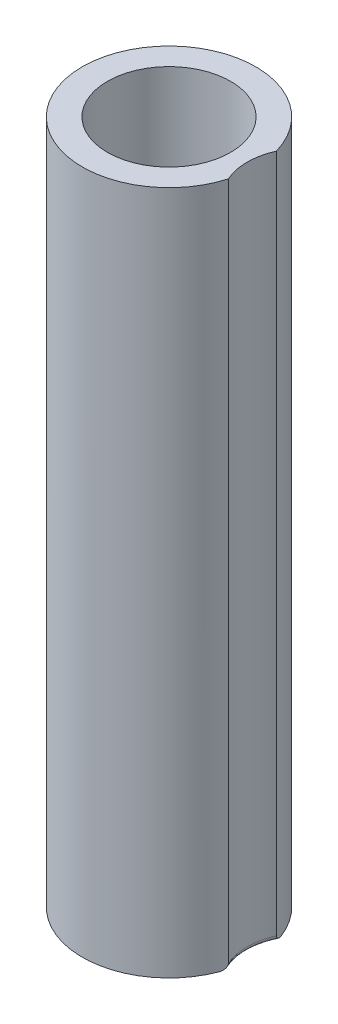
ISO-10303-21;
HEADER;
FILE_DESCRIPTION(('STEP AP214'),'2;1');
FILE_NAME('part.step','',(''),(''),'','','');
FILE_SCHEMA(('AUTOMOTIVE_DESIGN { 1 0 10303 214 1 1 1 1 }'));
ENDSEC;
DATA;
#1=APPLICATION_CONTEXT('core data for automotive mechanical design processes');
#2=APPLICATION_PROTOCOL_DEFINITION('international standard','automotive_design',2000,#1);
#3=PRODUCT_CONTEXT('',#1,'mechanical');
#4=PRODUCT('Part','Part','',(#3));
#5=PRODUCT_RELATED_PRODUCT_CATEGORY('part','',(#4));
#6=PRODUCT_DEFINITION_FORMATION('','',#4);
#7=PRODUCT_DEFINITION_CONTEXT('part definition',#1,'design');
#8=PRODUCT_DEFINITION('design','',#6,#7);
#9=PRODUCT_DEFINITION_SHAPE('','',#8);
#10=(LENGTH_UNIT() NAMED_UNIT(*) SI_UNIT(.MILLI.,.METRE.));
#11=(NAMED_UNIT(*) PLANE_ANGLE_UNIT() SI_UNIT($,.RADIAN.));
#12=(NAMED_UNIT(*) SI_UNIT($,.STERADIAN.) SOLID_ANGLE_UNIT());
#13=UNCERTAINTY_MEASURE_WITH_UNIT(LENGTH_MEASURE(1.E-05),#10,'distance_accuracy_value','');
#14=(GEOMETRIC_REPRESENTATION_CONTEXT(3) GLOBAL_UNCERTAINTY_ASSIGNED_CONTEXT((#13)) GLOBAL_UNIT_ASSIGNED_CONTEXT((#10,
#11,#12)) REPRESENTATION_CONTEXT('',''));
#15=CARTESIAN_POINT('',(0.,0.,0.));
#16=DIRECTION('',(0.,0.,1.));
#17=DIRECTION('',(1.,0.,0.));
#18=AXIS2_PLACEMENT_3D('',#15,#16,#17);
#19=CARTESIAN_POINT('',(7.,70.,0.));
#20=DIRECTION('',(0.,1.,0.));
#21=DIRECTION('',(0.,0.,1.));
#22=AXIS2_PLACEMENT_3D('',#19,#20,#21);
#23=PLANE('',#22);
#24=CARTESIAN_POINT('',(14.,70.,0.));
#25=DIRECTION('',(0.,-1.,0.));
#26=DIRECTION('',(0.,0.,1.));
#27=AXIS2_PLACEMENT_3D('',#24,#25,#26);
#28=CIRCLE('',#27,6.);
#29=CARTESIAN_POINT('',(8.52734375,70.,2.45968159917822));
#30=VERTEX_POINT('',#29);
#31=CARTESIAN_POINT('',(8.52734375,70.,-2.45968159917822));
#32=VERTEX_POINT('',#31);
#33=EDGE_CURVE('E82',#30,#32,#28,.T.);
#34=ORIENTED_EDGE('',*,*,#33,.T.);
#35=CARTESIAN_POINT('',(0.,70.,0.));
#36=DIRECTION('',(0.,1.,0.));
#37=DIRECTION('',(0.,0.,1.));
#38=AXIS2_PLACEMENT_3D('',#35,#36,#37);
#39=CIRCLE('',#38,8.875);
#40=EDGE_CURVE('E73',#32,#30,#39,.T.);
#41=ORIENTED_EDGE('',*,*,#40,.T.);
#42=EDGE_LOOP('',(#34,#41));
#43=FACE_BOUND('',#42,.T.);
#44=CARTESIAN_POINT('',(0.,70.,0.));
#45=DIRECTION('',(0.,1.,0.));
#46=DIRECTION('',(0.,0.,1.));
#47=AXIS2_PLACEMENT_3D('',#44,#45,#46);
#48=CIRCLE('',#47,6.3);
#49=CARTESIAN_POINT('',(0.,70.,6.3));
#50=VERTEX_POINT('',#49);
#51=EDGE_CURVE('E129',#50,#50,#48,.T.);
#52=ORIENTED_EDGE('',*,*,#51,.F.);
#53=EDGE_LOOP('',(#52));
#54=FACE_BOUND('',#53,.T.);
#55=ADVANCED_FACE('F42',(#43,#54),#23,.T.);
#56=CARTESIAN_POINT('',(7.,0.,0.));
#57=DIRECTION('',(0.,1.,0.));
#58=DIRECTION('',(0.,0.,1.));
#59=AXIS2_PLACEMENT_3D('',#56,#57,#58);
#60=PLANE('',#59);
#61=CARTESIAN_POINT('',(0.,0.,0.));
#62=DIRECTION('',(0.,1.,0.));
#63=DIRECTION('',(0.,0.,1.));
#64=AXIS2_PLACEMENT_3D('',#61,#62,#63);
#65=CIRCLE('',#64,8.875);
#66=CARTESIAN_POINT('',(8.30412946428572,0.,-3.13162239747736));
#67=VERTEX_POINT('',#66);
#68=CARTESIAN_POINT('',(8.30412946428572,0.,3.13162239747736));
#69=VERTEX_POINT('',#68);
#70=EDGE_CURVE('E86',#67,#69,#65,.T.);
#71=ORIENTED_EDGE('',*,*,#70,.F.);
#72=CARTESIAN_POINT('',(14.,0.,0.));
#73=DIRECTION('',(0.,1.,0.));
#74=DIRECTION('',(0.,0.,1.));
#75=AXIS2_PLACEMENT_3D('',#72,#73,#74);
#76=CIRCLE('',#75,6.5);
#77=EDGE_CURVE('E11',#67,#69,#76,.T.);
#78=ORIENTED_EDGE('',*,*,#77,.T.);
#79=EDGE_LOOP('',(#71,#78));
#80=FACE_BOUND('',#79,.T.);
#81=CARTESIAN_POINT('',(0.,0.,0.));
#82=DIRECTION('',(0.,1.,0.));
#83=DIRECTION('',(0.,0.,1.));
#84=AXIS2_PLACEMENT_3D('',#81,#82,#83);
#85=CIRCLE('',#84,6.3);
#86=CARTESIAN_POINT('',(0.,0.,6.3));
#87=VERTEX_POINT('',#86);
#88=EDGE_CURVE('E132',#87,#87,#85,.T.);
#89=ORIENTED_EDGE('',*,*,#88,.T.);
#90=EDGE_LOOP('',(#89));
#91=FACE_BOUND('',#90,.T.);
#92=ADVANCED_FACE('F109',(#80,#91),#60,.F.);
#93=CARTESIAN_POINT('',(14.,70.,0.));
#94=DIRECTION('',(0.,-1.,0.));
#95=DIRECTION('',(0.,0.,-1.));
#96=AXIS2_PLACEMENT_3D('',#93,#94,#95);
#97=CYLINDRICAL_SURFACE('',#96,6.);
#98=DIRECTION('',(0.,-1.,0.));
#99=VECTOR('',#98,1.);
#100=CARTESIAN_POINT('',(8.52734375,70.,2.45968159917822));
#101=LINE('',#100,#99);
#102=CARTESIAN_POINT('',(8.52734375,0.5,2.45968159917822));
#103=VERTEX_POINT('',#102);
#104=EDGE_CURVE('E79',#30,#103,#101,.T.);
#105=ORIENTED_EDGE('',*,*,#104,.T.);
#106=CARTESIAN_POINT('',(14.,0.5,0.));
#107=DIRECTION('',(0.,1.,0.));
#108=DIRECTION('',(0.,0.,1.));
#109=AXIS2_PLACEMENT_3D('',#106,#107,#108);
#110=CIRCLE('',#109,6.);
#111=CARTESIAN_POINT('',(8.52734375,0.5,-2.45968159917822));
#112=VERTEX_POINT('',#111);
#113=EDGE_CURVE('E91',#103,#112,#110,.F.);
#114=ORIENTED_EDGE('',*,*,#113,.T.);
#115=DIRECTION('',(0.,-1.,0.));
#116=VECTOR('',#115,1.);
#117=CARTESIAN_POINT('',(8.52734375,70.,-2.45968159917822));
#118=LINE('',#117,#116);
#119=EDGE_CURVE('E77',#32,#112,#118,.T.);
#120=ORIENTED_EDGE('',*,*,#119,.F.);
#121=ORIENTED_EDGE('',*,*,#33,.F.);
#122=EDGE_LOOP('',(#105,#114,#120,#121));
#123=FACE_BOUND('',#122,.T.);
#124=ADVANCED_FACE('F89',(#123),#97,.F.);
#125=CARTESIAN_POINT('',(0.,70.,0.));
#126=DIRECTION('',(0.,-1.,0.));
#127=DIRECTION('',(0.,0.,-1.));
#128=AXIS2_PLACEMENT_3D('',#125,#126,#127);
#129=CYLINDRICAL_SURFACE('',#128,8.875);
#130=ORIENTED_EDGE('',*,*,#119,.T.);
#131=CARTESIAN_POINT('',(8.52734375,0.5,-2.45968159917822));
#132=CARTESIAN_POINT('',(8.52735974154293,0.478248809978841,-2.45961704642143));
#133=CARTESIAN_POINT('',(8.52673673305596,0.456582262414753,-2.46178655928142));
#134=CARTESIAN_POINT('',(8.52436247411615,0.414306242412233,-2.46999968652766));
#135=CARTESIAN_POINT('',(8.52262427111198,0.393687483769011,-2.47599849523367));
#136=CARTESIAN_POINT('',(8.51817332243769,0.353954297391015,-2.49126608570204));
#137=CARTESIAN_POINT('',(8.51546494720757,0.334833584614769,-2.5005201996281));
#138=CARTESIAN_POINT('',(8.50923438740492,0.298190483384062,-2.5216419437464));
#139=CARTESIAN_POINT('',(8.50570966006928,0.2806733326182,-2.53351773437436));
#140=CARTESIAN_POINT('',(8.49592631120325,0.238444828241911,-2.5661805752451));
#141=CARTESIAN_POINT('',(8.48921396767972,0.21489893812663,-2.5883358317559));
#142=CARTESIAN_POINT('',(8.47459110196893,0.171713810995953,-2.63582128639476));
#143=CARTESIAN_POINT('',(8.46667782910967,0.152083788328269,-2.66115874963435));
#144=CARTESIAN_POINT('',(8.44647887005652,0.109274917747803,-2.72472580190712));
#145=CARTESIAN_POINT('',(8.43372220541257,0.0878899497465187,-2.76401370730204));
#146=CARTESIAN_POINT('',(8.40671708056931,0.051987873673843,-2.84509537208662));
#147=CARTESIAN_POINT('',(8.39246779229128,0.0374746027952326,-2.88689051689138));
#148=CARTESIAN_POINT('',(8.36598600763841,0.0176870828332947,-2.9626242294477));
#149=CARTESIAN_POINT('',(8.35398491626087,0.0110927526004973,-2.99630435797964));
#150=CARTESIAN_POINT('',(8.32943837942698,0.00226683280594707,-3.06388433648061));
#151=CARTESIAN_POINT('',(8.31689521528374,1.84925533166583E-05,-3.09778283552914));
#152=CARTESIAN_POINT('',(8.30412946428572,0.,-3.13162239747736));
#153=B_SPLINE_CURVE_WITH_KNOTS('',3,(#131,#132,#133,#134,#135,#136,#137,#138,#139,#140,#141,
#142,#143,#144,#145,#146,#147,#148,#149,#150,#151,#152),.UNSPECIFIED.,.F.,.F.,(4,2,2,2,2,2,2,2,
2,2,4),(0.,0.065002716686067,0.129258455507311,0.193228301440888,0.257400145177912,
0.355906789668323,0.454642562645632,0.593456839210127,0.732348539263378,0.84116536302206,
0.949561932645654),.UNSPECIFIED.);
#154=EDGE_CURVE('E51',#112,#67,#153,.T.);
#155=ORIENTED_EDGE('',*,*,#154,.T.);
#156=ORIENTED_EDGE('',*,*,#70,.T.);
#157=CARTESIAN_POINT('',(8.30412946428571,0.,3.13162239747736));
#158=CARTESIAN_POINT('',(8.31897743553063,3.38918326178269E-05,3.09227160032919));
#159=CARTESIAN_POINT('',(8.33352191941732,0.00306613947622345,3.05283564235225));
#160=CARTESIAN_POINT('',(8.36191020384529,0.0149823594547551,2.97419063225707));
#161=CARTESIAN_POINT('',(8.37574657062557,0.0239184473294966,2.9349867675314));
#162=CARTESIAN_POINT('',(8.40490726635835,0.0497547413847219,2.85053147383329));
#163=CARTESIAN_POINT('',(8.42000664150233,0.0678553235102566,2.80556548658622));
#164=CARTESIAN_POINT('',(8.44825266516761,0.11231798431956,2.71931714808266));
#165=CARTESIAN_POINT('',(8.46140655570676,0.138648226522583,2.678021376157));
#166=CARTESIAN_POINT('',(8.47975049286966,0.186237872803726,2.61914869473023));
#167=CARTESIAN_POINT('',(8.48584494815482,0.20437259375752,2.59931496506228));
#168=CARTESIAN_POINT('',(8.49709116199649,0.243458039786484,2.56231085356289));
#169=CARTESIAN_POINT('',(8.50224413658575,0.264405070854976,2.54513704056886));
#170=CARTESIAN_POINT('',(8.51041421221731,0.304517423407202,2.51766512653399));
#171=CARTESIAN_POINT('',(8.51365262670018,0.3231631599306,2.5066793517425));
#172=CARTESIAN_POINT('',(8.51920041165056,0.362044625808575,2.48775929602025));
#173=CARTESIAN_POINT('',(8.52151247602113,0.38227553714888,2.47981616981897));
#174=CARTESIAN_POINT('',(8.52460355085472,0.418736802002778,2.4691665431847));
#175=CARTESIAN_POINT('',(8.52562086509984,0.434710170430191,2.4656488609292));
#176=CARTESIAN_POINT('',(8.5269957435812,0.467111790878714,2.46088813863067));
#177=CARTESIAN_POINT('',(8.52734943494754,0.483542148731711,2.45965845155808));
#178=CARTESIAN_POINT('',(8.52734375,0.500000000000002,2.45968159917822));
#179=B_SPLINE_CURVE_WITH_KNOTS('',3,(#157,#158,#159,#160,#161,#162,#163,#164,#165,#166,#167,
#168,#169,#170,#171,#172,#173,#174,#175,#176,#177,#178),.UNSPECIFIED.,.F.,.F.,(4,2,2,2,2,2,2,2,
2,2,4),(0.,0.126030556350028,0.253188770843927,0.404780589959263,0.555793085900379,
0.638247837309511,0.720595324000989,0.786006805081127,0.851226658873039,0.90021979875344,
0.949497981389712),.UNSPECIFIED.);
#180=EDGE_CURVE('E93',#69,#103,#179,.T.);
#181=ORIENTED_EDGE('',*,*,#180,.T.);
#182=ORIENTED_EDGE('',*,*,#104,.F.);
#183=ORIENTED_EDGE('',*,*,#40,.F.);
#184=EDGE_LOOP('',(#130,#155,#156,#181,#182,#183));
#185=FACE_BOUND('',#184,.T.);
#186=ADVANCED_FACE('F75',(#185),#129,.T.);
#187=CARTESIAN_POINT('',(0.,70.,0.));
#188=DIRECTION('',(0.,-1.,0.));
#189=DIRECTION('',(0.,0.,-1.));
#190=AXIS2_PLACEMENT_3D('',#187,#188,#189);
#191=CYLINDRICAL_SURFACE('',#190,6.3);
#192=ORIENTED_EDGE('',*,*,#51,.T.);
#193=EDGE_LOOP('',(#192));
#194=FACE_BOUND('',#193,.T.);
#195=ORIENTED_EDGE('',*,*,#88,.F.);
#196=EDGE_LOOP('',(#195));
#197=FACE_BOUND('',#196,.T.);
#198=ADVANCED_FACE('F108',(#194,#197),#191,.F.);
#199=CARTESIAN_POINT('',(14.,0.5,0.));
#200=DIRECTION('',(0.,1.,0.));
#201=DIRECTION('',(0.,0.,1.));
#202=AXIS2_PLACEMENT_3D('',#199,#200,#201);
#203=TOROIDAL_SURFACE('',#202,6.5,0.5);
#204=ORIENTED_EDGE('',*,*,#180,.F.);
#205=ORIENTED_EDGE('',*,*,#77,.F.);
#206=ORIENTED_EDGE('',*,*,#154,.F.);
#207=ORIENTED_EDGE('',*,*,#113,.F.);
#208=EDGE_LOOP('',(#204,#205,#206,#207));
#209=FACE_BOUND('',#208,.T.);
#210=ADVANCED_FACE('F44',(#209),#203,.T.);
#211=CLOSED_SHELL('',(#55,#92,#124,#186,#198,#210));
#212=MANIFOLD_SOLID_BREP('B2',#211);
#213=ADVANCED_BREP_SHAPE_REPRESENTATION('',(#18,#212),#14);
#214=SHAPE_DEFINITION_REPRESENTATION(#9,#213);
ENDSEC;
END-ISO-10303-21;
